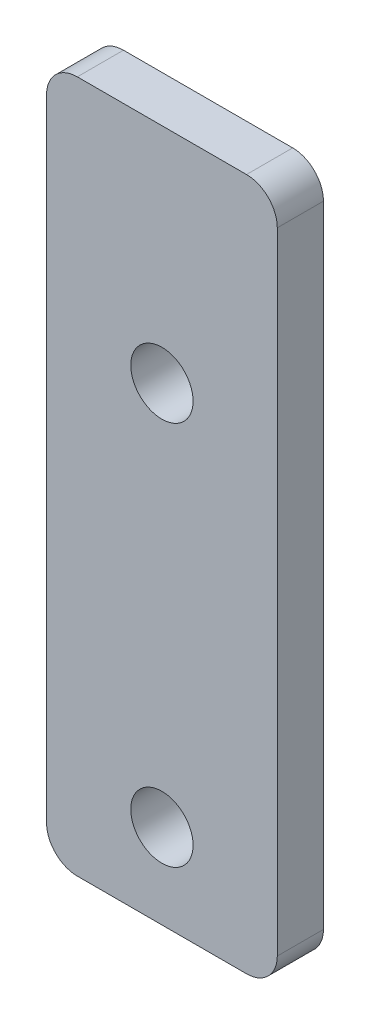
ISO-10303-21;
HEADER;
FILE_DESCRIPTION(('STEP AP214'),'2;1');
FILE_NAME('part.step','',(''),(''),'','','');
FILE_SCHEMA(('AUTOMOTIVE_DESIGN { 1 0 10303 214 1 1 1 1 }'));
ENDSEC;
DATA;
#1=APPLICATION_CONTEXT('core data for automotive mechanical design processes');
#2=APPLICATION_PROTOCOL_DEFINITION('international standard','automotive_design',2000,#1);
#3=PRODUCT_CONTEXT('',#1,'mechanical');
#4=PRODUCT('Part','Part','',(#3));
#5=PRODUCT_RELATED_PRODUCT_CATEGORY('part','',(#4));
#6=PRODUCT_DEFINITION_FORMATION('','',#4);
#7=PRODUCT_DEFINITION_CONTEXT('part definition',#1,'design');
#8=PRODUCT_DEFINITION('design','',#6,#7);
#9=PRODUCT_DEFINITION_SHAPE('','',#8);
#10=(LENGTH_UNIT() NAMED_UNIT(*) SI_UNIT(.MILLI.,.METRE.));
#11=(NAMED_UNIT(*) PLANE_ANGLE_UNIT() SI_UNIT($,.RADIAN.));
#12=(NAMED_UNIT(*) SI_UNIT($,.STERADIAN.) SOLID_ANGLE_UNIT());
#13=UNCERTAINTY_MEASURE_WITH_UNIT(LENGTH_MEASURE(1.E-05),#10,'distance_accuracy_value','');
#14=(GEOMETRIC_REPRESENTATION_CONTEXT(3) GLOBAL_UNCERTAINTY_ASSIGNED_CONTEXT((#13)) GLOBAL_UNIT_ASSIGNED_CONTEXT((#10,
#11,#12)) REPRESENTATION_CONTEXT('',''));
#15=CARTESIAN_POINT('',(0.,0.,0.));
#16=DIRECTION('',(0.,0.,1.));
#17=DIRECTION('',(1.,0.,0.));
#18=AXIS2_PLACEMENT_3D('',#15,#16,#17);
#19=CARTESIAN_POINT('',(7.5,-22.5,3.));
#20=DIRECTION('',(-1.,0.,0.));
#21=DIRECTION('',(0.,0.,1.));
#22=AXIS2_PLACEMENT_3D('',#19,#20,#21);
#23=PLANE('',#22);
#24=DIRECTION('',(0.,1.,0.));
#25=VECTOR('',#24,1.);
#26=CARTESIAN_POINT('',(7.5,-22.5,3.));
#27=LINE('',#26,#25);
#28=CARTESIAN_POINT('',(7.5,-20.5,3.));
#29=VERTEX_POINT('',#28);
#30=CARTESIAN_POINT('',(7.5,20.5,3.));
#31=VERTEX_POINT('',#30);
#32=EDGE_CURVE('E122',#29,#31,#27,.T.);
#33=ORIENTED_EDGE('',*,*,#32,.F.);
#34=DIRECTION('',(0.,0.,-1.));
#35=VECTOR('',#34,1.);
#36=CARTESIAN_POINT('',(7.5,-20.5,3.));
#37=LINE('',#36,#35);
#38=CARTESIAN_POINT('',(7.5,-20.5,0.));
#39=VERTEX_POINT('',#38);
#40=EDGE_CURVE('E107',#29,#39,#37,.T.);
#41=ORIENTED_EDGE('',*,*,#40,.T.);
#42=DIRECTION('',(0.,1.,0.));
#43=VECTOR('',#42,1.);
#44=CARTESIAN_POINT('',(7.5,-22.5,0.));
#45=LINE('',#44,#43);
#46=CARTESIAN_POINT('',(7.5,20.5,0.));
#47=VERTEX_POINT('',#46);
#48=EDGE_CURVE('E119',#39,#47,#45,.T.);
#49=ORIENTED_EDGE('',*,*,#48,.T.);
#50=DIRECTION('',(0.,0.,-1.));
#51=VECTOR('',#50,1.);
#52=CARTESIAN_POINT('',(7.5,20.5,3.));
#53=LINE('',#52,#51);
#54=EDGE_CURVE('E124',#47,#31,#53,.F.);
#55=ORIENTED_EDGE('',*,*,#54,.T.);
#56=EDGE_LOOP('',(#33,#41,#49,#55));
#57=FACE_BOUND('',#56,.T.);
#58=ADVANCED_FACE('F37',(#57),#23,.F.);
#59=CARTESIAN_POINT('',(-7.5,22.5,3.));
#60=DIRECTION('',(0.,-1.,0.));
#61=DIRECTION('',(0.,0.,-1.));
#62=AXIS2_PLACEMENT_3D('',#59,#60,#61);
#63=PLANE('',#62);
#64=DIRECTION('',(-1.,0.,0.));
#65=VECTOR('',#64,1.);
#66=CARTESIAN_POINT('',(-7.5,22.5,0.));
#67=LINE('',#66,#65);
#68=CARTESIAN_POINT('',(5.5,22.5,0.));
#69=VERTEX_POINT('',#68);
#70=CARTESIAN_POINT('',(-5.5,22.5,0.));
#71=VERTEX_POINT('',#70);
#72=EDGE_CURVE('E128',#69,#71,#67,.T.);
#73=ORIENTED_EDGE('',*,*,#72,.T.);
#74=DIRECTION('',(0.,0.,-1.));
#75=VECTOR('',#74,1.);
#76=CARTESIAN_POINT('',(-5.5,22.5,3.));
#77=LINE('',#76,#75);
#78=CARTESIAN_POINT('',(-5.5,22.5,3.));
#79=VERTEX_POINT('',#78);
#80=EDGE_CURVE('E11',#71,#79,#77,.F.);
#81=ORIENTED_EDGE('',*,*,#80,.T.);
#82=DIRECTION('',(-1.,0.,0.));
#83=VECTOR('',#82,1.);
#84=CARTESIAN_POINT('',(-7.5,22.5,3.));
#85=LINE('',#84,#83);
#86=CARTESIAN_POINT('',(5.5,22.5,3.));
#87=VERTEX_POINT('',#86);
#88=EDGE_CURVE('E168',#87,#79,#85,.T.);
#89=ORIENTED_EDGE('',*,*,#88,.F.);
#90=DIRECTION('',(0.,0.,-1.));
#91=VECTOR('',#90,1.);
#92=CARTESIAN_POINT('',(5.5,22.5,3.));
#93=LINE('',#92,#91);
#94=EDGE_CURVE('E45',#87,#69,#93,.T.);
#95=ORIENTED_EDGE('',*,*,#94,.T.);
#96=EDGE_LOOP('',(#73,#81,#89,#95));
#97=FACE_BOUND('',#96,.T.);
#98=ADVANCED_FACE('F166',(#97),#63,.F.);
#99=CARTESIAN_POINT('',(-7.5,-22.5,3.));
#100=DIRECTION('',(1.,0.,0.));
#101=DIRECTION('',(0.,0.,-1.));
#102=AXIS2_PLACEMENT_3D('',#99,#100,#101);
#103=PLANE('',#102);
#104=DIRECTION('',(0.,-1.,0.));
#105=VECTOR('',#104,1.);
#106=CARTESIAN_POINT('',(-7.5,-22.5,0.));
#107=LINE('',#106,#105);
#108=CARTESIAN_POINT('',(-7.5,20.5,0.));
#109=VERTEX_POINT('',#108);
#110=CARTESIAN_POINT('',(-7.5,-20.5,0.));
#111=VERTEX_POINT('',#110);
#112=EDGE_CURVE('E132',#109,#111,#107,.T.);
#113=ORIENTED_EDGE('',*,*,#112,.T.);
#114=DIRECTION('',(0.,0.,-1.));
#115=VECTOR('',#114,1.);
#116=CARTESIAN_POINT('',(-7.5,-20.5,3.));
#117=LINE('',#116,#115);
#118=CARTESIAN_POINT('',(-7.5,-20.5,3.));
#119=VERTEX_POINT('',#118);
#120=EDGE_CURVE('E52',#111,#119,#117,.F.);
#121=ORIENTED_EDGE('',*,*,#120,.T.);
#122=DIRECTION('',(0.,-1.,0.));
#123=VECTOR('',#122,1.);
#124=CARTESIAN_POINT('',(-7.5,-22.5,3.));
#125=LINE('',#124,#123);
#126=CARTESIAN_POINT('',(-7.5,20.5,3.));
#127=VERTEX_POINT('',#126);
#128=EDGE_CURVE('E176',#127,#119,#125,.T.);
#129=ORIENTED_EDGE('',*,*,#128,.F.);
#130=DIRECTION('',(0.,0.,-1.));
#131=VECTOR('',#130,1.);
#132=CARTESIAN_POINT('',(-7.5,20.5,3.));
#133=LINE('',#132,#131);
#134=EDGE_CURVE('E159',#127,#109,#133,.T.);
#135=ORIENTED_EDGE('',*,*,#134,.T.);
#136=EDGE_LOOP('',(#113,#121,#129,#135));
#137=FACE_BOUND('',#136,.T.);
#138=ADVANCED_FACE('F175',(#137),#103,.F.);
#139=CARTESIAN_POINT('',(-7.5,-22.5,3.));
#140=DIRECTION('',(0.,1.,0.));
#141=DIRECTION('',(0.,0.,1.));
#142=AXIS2_PLACEMENT_3D('',#139,#140,#141);
#143=PLANE('',#142);
#144=DIRECTION('',(1.,0.,0.));
#145=VECTOR('',#144,1.);
#146=CARTESIAN_POINT('',(-7.5,-22.5,0.));
#147=LINE('',#146,#145);
#148=CARTESIAN_POINT('',(-5.5,-22.5,0.));
#149=VERTEX_POINT('',#148);
#150=CARTESIAN_POINT('',(5.5,-22.5,0.));
#151=VERTEX_POINT('',#150);
#152=EDGE_CURVE('E142',#149,#151,#147,.T.);
#153=ORIENTED_EDGE('',*,*,#152,.T.);
#154=DIRECTION('',(0.,0.,-1.));
#155=VECTOR('',#154,1.);
#156=CARTESIAN_POINT('',(5.5,-22.5,3.));
#157=LINE('',#156,#155);
#158=CARTESIAN_POINT('',(5.5,-22.5,3.));
#159=VERTEX_POINT('',#158);
#160=EDGE_CURVE('E108',#151,#159,#157,.F.);
#161=ORIENTED_EDGE('',*,*,#160,.T.);
#162=DIRECTION('',(1.,0.,0.));
#163=VECTOR('',#162,1.);
#164=CARTESIAN_POINT('',(-7.5,-22.5,3.));
#165=LINE('',#164,#163);
#166=CARTESIAN_POINT('',(-5.5,-22.5,3.));
#167=VERTEX_POINT('',#166);
#168=EDGE_CURVE('E138',#167,#159,#165,.T.);
#169=ORIENTED_EDGE('',*,*,#168,.F.);
#170=DIRECTION('',(0.,0.,-1.));
#171=VECTOR('',#170,1.);
#172=CARTESIAN_POINT('',(-5.5,-22.5,3.));
#173=LINE('',#172,#171);
#174=EDGE_CURVE('E113',#167,#149,#173,.T.);
#175=ORIENTED_EDGE('',*,*,#174,.T.);
#176=EDGE_LOOP('',(#153,#161,#169,#175));
#177=FACE_BOUND('',#176,.T.);
#178=ADVANCED_FACE('F196',(#177),#143,.F.);
#179=CARTESIAN_POINT('',(0.,0.,3.));
#180=DIRECTION('',(0.,0.,-1.));
#181=DIRECTION('',(-1.,0.,0.));
#182=AXIS2_PLACEMENT_3D('',#179,#180,#181);
#183=PLANE('',#182);
#184=CARTESIAN_POINT('',(0.,-17.,3.));
#185=DIRECTION('',(0.,0.,1.));
#186=DIRECTION('',(1.,0.,0.));
#187=AXIS2_PLACEMENT_3D('',#184,#185,#186);
#188=CIRCLE('',#187,2.025);
#189=CARTESIAN_POINT('',(2.025,-17.,3.));
#190=VERTEX_POINT('',#189);
#191=EDGE_CURVE('E135',#190,#190,#188,.T.);
#192=ORIENTED_EDGE('',*,*,#191,.F.);
#193=EDGE_LOOP('',(#192));
#194=FACE_BOUND('',#193,.T.);
#195=CARTESIAN_POINT('',(0.,8.,3.));
#196=DIRECTION('',(0.,0.,1.));
#197=DIRECTION('',(1.,0.,0.));
#198=AXIS2_PLACEMENT_3D('',#195,#196,#197);
#199=CIRCLE('',#198,2.025);
#200=CARTESIAN_POINT('',(2.025,8.,3.));
#201=VERTEX_POINT('',#200);
#202=EDGE_CURVE('E182',#201,#201,#199,.T.);
#203=ORIENTED_EDGE('',*,*,#202,.F.);
#204=EDGE_LOOP('',(#203));
#205=FACE_BOUND('',#204,.T.);
#206=ORIENTED_EDGE('',*,*,#168,.T.);
#207=CARTESIAN_POINT('',(5.5,-20.5,3.));
#208=DIRECTION('',(0.,0.,-1.));
#209=DIRECTION('',(-1.,0.,0.));
#210=AXIS2_PLACEMENT_3D('',#207,#208,#209);
#211=CIRCLE('',#210,2.);
#212=EDGE_CURVE('E157',#159,#29,#211,.F.);
#213=ORIENTED_EDGE('',*,*,#212,.T.);
#214=ORIENTED_EDGE('',*,*,#32,.T.);
#215=CARTESIAN_POINT('',(5.5,20.5,3.));
#216=DIRECTION('',(0.,0.,-1.));
#217=DIRECTION('',(-1.,0.,0.));
#218=AXIS2_PLACEMENT_3D('',#215,#216,#217);
#219=CIRCLE('',#218,2.);
#220=EDGE_CURVE('E152',#31,#87,#219,.F.);
#221=ORIENTED_EDGE('',*,*,#220,.T.);
#222=ORIENTED_EDGE('',*,*,#88,.T.);
#223=CARTESIAN_POINT('',(-5.5,20.5,3.));
#224=DIRECTION('',(0.,0.,-1.));
#225=DIRECTION('',(-1.,0.,0.));
#226=AXIS2_PLACEMENT_3D('',#223,#224,#225);
#227=CIRCLE('',#226,2.);
#228=EDGE_CURVE('E59',#79,#127,#227,.F.);
#229=ORIENTED_EDGE('',*,*,#228,.T.);
#230=ORIENTED_EDGE('',*,*,#128,.T.);
#231=CARTESIAN_POINT('',(-5.5,-20.5,3.));
#232=DIRECTION('',(0.,0.,-1.));
#233=DIRECTION('',(-1.,0.,0.));
#234=AXIS2_PLACEMENT_3D('',#231,#232,#233);
#235=CIRCLE('',#234,2.);
#236=EDGE_CURVE('E155',#119,#167,#235,.F.);
#237=ORIENTED_EDGE('',*,*,#236,.T.);
#238=EDGE_LOOP('',(#206,#213,#214,#221,#222,#229,#230,#237));
#239=FACE_BOUND('',#238,.T.);
#240=ADVANCED_FACE('F193',(#194,#205,#239),#183,.F.);
#241=CARTESIAN_POINT('',(0.,0.,0.));
#242=DIRECTION('',(0.,0.,-1.));
#243=DIRECTION('',(-1.,0.,0.));
#244=AXIS2_PLACEMENT_3D('',#241,#242,#243);
#245=PLANE('',#244);
#246=CARTESIAN_POINT('',(0.,-17.,0.));
#247=DIRECTION('',(0.,0.,1.));
#248=DIRECTION('',(1.,0.,0.));
#249=AXIS2_PLACEMENT_3D('',#246,#247,#248);
#250=CIRCLE('',#249,2.025);
#251=CARTESIAN_POINT('',(2.025,-17.,0.));
#252=VERTEX_POINT('',#251);
#253=EDGE_CURVE('E129',#252,#252,#250,.T.);
#254=ORIENTED_EDGE('',*,*,#253,.T.);
#255=EDGE_LOOP('',(#254));
#256=FACE_BOUND('',#255,.T.);
#257=CARTESIAN_POINT('',(0.,8.,0.));
#258=DIRECTION('',(0.,0.,1.));
#259=DIRECTION('',(1.,0.,0.));
#260=AXIS2_PLACEMENT_3D('',#257,#258,#259);
#261=CIRCLE('',#260,2.025);
#262=CARTESIAN_POINT('',(2.025,8.,0.));
#263=VERTEX_POINT('',#262);
#264=EDGE_CURVE('E185',#263,#263,#261,.T.);
#265=ORIENTED_EDGE('',*,*,#264,.T.);
#266=EDGE_LOOP('',(#265));
#267=FACE_BOUND('',#266,.T.);
#268=ORIENTED_EDGE('',*,*,#48,.F.);
#269=CARTESIAN_POINT('',(5.5,-20.5,0.));
#270=DIRECTION('',(0.,0.,-1.));
#271=DIRECTION('',(-1.,0.,0.));
#272=AXIS2_PLACEMENT_3D('',#269,#270,#271);
#273=CIRCLE('',#272,2.);
#274=EDGE_CURVE('E103',#39,#151,#273,.T.);
#275=ORIENTED_EDGE('',*,*,#274,.T.);
#276=ORIENTED_EDGE('',*,*,#152,.F.);
#277=CARTESIAN_POINT('',(-5.5,-20.5,0.));
#278=DIRECTION('',(0.,0.,-1.));
#279=DIRECTION('',(-1.,0.,0.));
#280=AXIS2_PLACEMENT_3D('',#277,#278,#279);
#281=CIRCLE('',#280,2.);
#282=EDGE_CURVE('E114',#149,#111,#281,.T.);
#283=ORIENTED_EDGE('',*,*,#282,.T.);
#284=ORIENTED_EDGE('',*,*,#112,.F.);
#285=CARTESIAN_POINT('',(-5.5,20.5,0.));
#286=DIRECTION('',(0.,0.,-1.));
#287=DIRECTION('',(-1.,0.,0.));
#288=AXIS2_PLACEMENT_3D('',#285,#286,#287);
#289=CIRCLE('',#288,2.);
#290=EDGE_CURVE('E146',#109,#71,#289,.T.);
#291=ORIENTED_EDGE('',*,*,#290,.T.);
#292=ORIENTED_EDGE('',*,*,#72,.F.);
#293=CARTESIAN_POINT('',(5.5,20.5,0.));
#294=DIRECTION('',(0.,0.,-1.));
#295=DIRECTION('',(-1.,0.,0.));
#296=AXIS2_PLACEMENT_3D('',#293,#294,#295);
#297=CIRCLE('',#296,2.);
#298=EDGE_CURVE('E123',#69,#47,#297,.T.);
#299=ORIENTED_EDGE('',*,*,#298,.T.);
#300=EDGE_LOOP('',(#268,#275,#276,#283,#284,#291,#292,#299));
#301=FACE_BOUND('',#300,.T.);
#302=ADVANCED_FACE('F126',(#256,#267,#301),#245,.T.);
#303=CARTESIAN_POINT('',(0.,8.,0.));
#304=DIRECTION('',(0.,0.,1.));
#305=DIRECTION('',(1.,0.,0.));
#306=AXIS2_PLACEMENT_3D('',#303,#304,#305);
#307=CYLINDRICAL_SURFACE('',#306,2.025);
#308=ORIENTED_EDGE('',*,*,#264,.F.);
#309=EDGE_LOOP('',(#308));
#310=FACE_BOUND('',#309,.T.);
#311=ORIENTED_EDGE('',*,*,#202,.T.);
#312=EDGE_LOOP('',(#311));
#313=FACE_BOUND('',#312,.T.);
#314=ADVANCED_FACE('F223',(#310,#313),#307,.F.);
#315=CARTESIAN_POINT('',(0.,-17.,0.));
#316=DIRECTION('',(0.,0.,1.));
#317=DIRECTION('',(1.,0.,0.));
#318=AXIS2_PLACEMENT_3D('',#315,#316,#317);
#319=CYLINDRICAL_SURFACE('',#318,2.025);
#320=ORIENTED_EDGE('',*,*,#253,.F.);
#321=EDGE_LOOP('',(#320));
#322=FACE_BOUND('',#321,.T.);
#323=ORIENTED_EDGE('',*,*,#191,.T.);
#324=EDGE_LOOP('',(#323));
#325=FACE_BOUND('',#324,.T.);
#326=ADVANCED_FACE('F191',(#322,#325),#319,.F.);
#327=CARTESIAN_POINT('',(5.5,-20.5,3.));
#328=DIRECTION('',(0.,0.,-1.));
#329=DIRECTION('',(-1.,0.,0.));
#330=AXIS2_PLACEMENT_3D('',#327,#328,#329);
#331=CYLINDRICAL_SURFACE('',#330,2.);
#332=ORIENTED_EDGE('',*,*,#212,.F.);
#333=ORIENTED_EDGE('',*,*,#160,.F.);
#334=ORIENTED_EDGE('',*,*,#274,.F.);
#335=ORIENTED_EDGE('',*,*,#40,.F.);
#336=EDGE_LOOP('',(#332,#333,#334,#335));
#337=FACE_BOUND('',#336,.T.);
#338=ADVANCED_FACE('F106',(#337),#331,.T.);
#339=CARTESIAN_POINT('',(-5.5,-20.5,3.));
#340=DIRECTION('',(0.,0.,-1.));
#341=DIRECTION('',(-1.,0.,0.));
#342=AXIS2_PLACEMENT_3D('',#339,#340,#341);
#343=CYLINDRICAL_SURFACE('',#342,2.);
#344=ORIENTED_EDGE('',*,*,#236,.F.);
#345=ORIENTED_EDGE('',*,*,#120,.F.);
#346=ORIENTED_EDGE('',*,*,#282,.F.);
#347=ORIENTED_EDGE('',*,*,#174,.F.);
#348=EDGE_LOOP('',(#344,#345,#346,#347));
#349=FACE_BOUND('',#348,.T.);
#350=ADVANCED_FACE('F203',(#349),#343,.T.);
#351=CARTESIAN_POINT('',(-5.5,20.5,3.));
#352=DIRECTION('',(0.,0.,-1.));
#353=DIRECTION('',(-1.,0.,0.));
#354=AXIS2_PLACEMENT_3D('',#351,#352,#353);
#355=CYLINDRICAL_SURFACE('',#354,2.);
#356=ORIENTED_EDGE('',*,*,#228,.F.);
#357=ORIENTED_EDGE('',*,*,#80,.F.);
#358=ORIENTED_EDGE('',*,*,#290,.F.);
#359=ORIENTED_EDGE('',*,*,#134,.F.);
#360=EDGE_LOOP('',(#356,#357,#358,#359));
#361=FACE_BOUND('',#360,.T.);
#362=ADVANCED_FACE('F174',(#361),#355,.T.);
#363=CARTESIAN_POINT('',(5.5,20.5,3.));
#364=DIRECTION('',(0.,0.,-1.));
#365=DIRECTION('',(-1.,0.,0.));
#366=AXIS2_PLACEMENT_3D('',#363,#364,#365);
#367=CYLINDRICAL_SURFACE('',#366,2.);
#368=ORIENTED_EDGE('',*,*,#220,.F.);
#369=ORIENTED_EDGE('',*,*,#54,.F.);
#370=ORIENTED_EDGE('',*,*,#298,.F.);
#371=ORIENTED_EDGE('',*,*,#94,.F.);
#372=EDGE_LOOP('',(#368,#369,#370,#371));
#373=FACE_BOUND('',#372,.T.);
#374=ADVANCED_FACE('F39',(#373),#367,.T.);
#375=CLOSED_SHELL('',(#58,#98,#138,#178,#240,#302,#314,#326,#338,#350,#362,#374));
#376=MANIFOLD_SOLID_BREP('B2',#375);
#377=ADVANCED_BREP_SHAPE_REPRESENTATION('',(#18,#376),#14);
#378=SHAPE_DEFINITION_REPRESENTATION(#9,#377);
ENDSEC;
END-ISO-10303-21;
